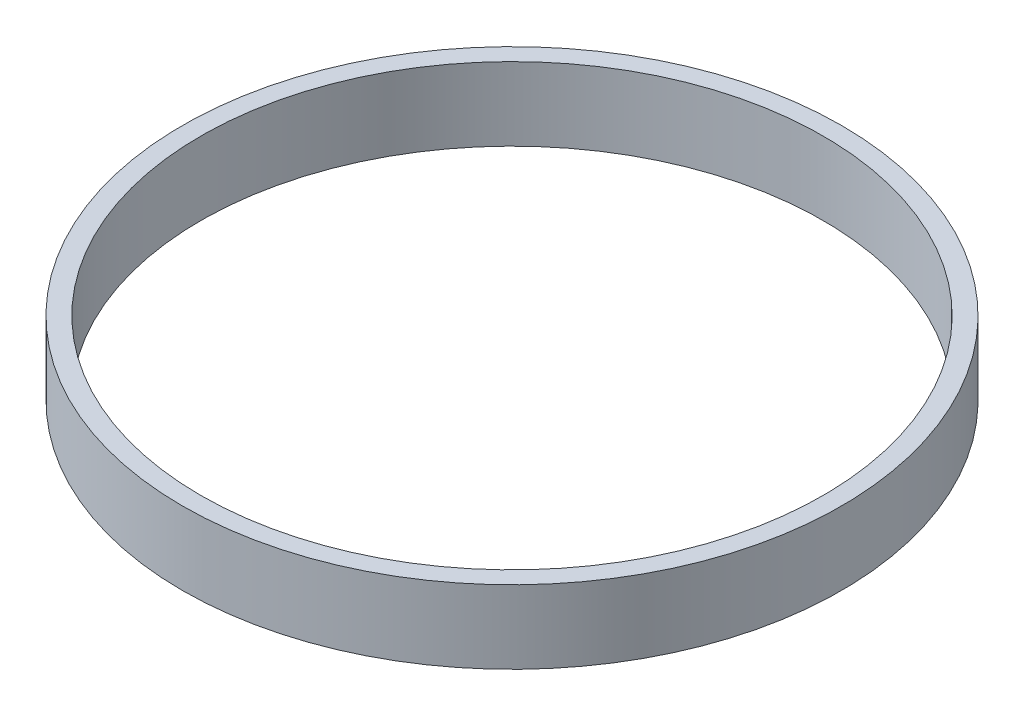
ISO-10303-21;
HEADER;
FILE_DESCRIPTION(('STEP AP214'),'2;1');
FILE_NAME('part.step','',(''),(''),'','','');
FILE_SCHEMA(('AUTOMOTIVE_DESIGN { 1 0 10303 214 1 1 1 1 }'));
ENDSEC;
DATA;
#1=APPLICATION_CONTEXT('core data for automotive mechanical design processes');
#2=APPLICATION_PROTOCOL_DEFINITION('international standard','automotive_design',2000,#1);
#3=PRODUCT_CONTEXT('',#1,'mechanical');
#4=PRODUCT('Part','Part','',(#3));
#5=PRODUCT_RELATED_PRODUCT_CATEGORY('part','',(#4));
#6=PRODUCT_DEFINITION_FORMATION('','',#4);
#7=PRODUCT_DEFINITION_CONTEXT('part definition',#1,'design');
#8=PRODUCT_DEFINITION('design','',#6,#7);
#9=PRODUCT_DEFINITION_SHAPE('','',#8);
#10=(LENGTH_UNIT() NAMED_UNIT(*) SI_UNIT(.MILLI.,.METRE.));
#11=(NAMED_UNIT(*) PLANE_ANGLE_UNIT() SI_UNIT($,.RADIAN.));
#12=(NAMED_UNIT(*) SI_UNIT($,.STERADIAN.) SOLID_ANGLE_UNIT());
#13=UNCERTAINTY_MEASURE_WITH_UNIT(LENGTH_MEASURE(1.E-05),#10,'distance_accuracy_value','');
#14=(GEOMETRIC_REPRESENTATION_CONTEXT(3) GLOBAL_UNCERTAINTY_ASSIGNED_CONTEXT((#13)) GLOBAL_UNIT_ASSIGNED_CONTEXT((#10,
#11,#12)) REPRESENTATION_CONTEXT('',''));
#15=CARTESIAN_POINT('',(0.,0.,0.));
#16=DIRECTION('',(0.,0.,1.));
#17=DIRECTION('',(1.,0.,0.));
#18=AXIS2_PLACEMENT_3D('',#15,#16,#17);
#19=CARTESIAN_POINT('',(0.,10.,0.));
#20=DIRECTION('',(0.,-1.,0.));
#21=DIRECTION('',(0.,0.,-1.));
#22=AXIS2_PLACEMENT_3D('',#19,#20,#21);
#23=CYLINDRICAL_SURFACE('',#22,45.);
#24=CARTESIAN_POINT('',(0.,10.,0.));
#25=DIRECTION('',(0.,1.,0.));
#26=DIRECTION('',(0.,0.,1.));
#27=AXIS2_PLACEMENT_3D('',#24,#25,#26);
#28=CIRCLE('',#27,45.);
#29=CARTESIAN_POINT('',(0.,10.,45.));
#30=VERTEX_POINT('',#29);
#31=EDGE_CURVE('E10',#30,#30,#28,.T.);
#32=ORIENTED_EDGE('',*,*,#31,.F.);
#33=EDGE_LOOP('',(#32));
#34=FACE_BOUND('',#33,.T.);
#35=CARTESIAN_POINT('',(0.,0.,0.));
#36=DIRECTION('',(0.,1.,0.));
#37=DIRECTION('',(0.,0.,1.));
#38=AXIS2_PLACEMENT_3D('',#35,#36,#37);
#39=CIRCLE('',#38,45.);
#40=CARTESIAN_POINT('',(0.,0.,45.));
#41=VERTEX_POINT('',#40);
#42=EDGE_CURVE('E37',#41,#41,#39,.T.);
#43=ORIENTED_EDGE('',*,*,#42,.T.);
#44=EDGE_LOOP('',(#43));
#45=FACE_BOUND('',#44,.T.);
#46=ADVANCED_FACE('F30',(#34,#45),#23,.T.);
#47=CARTESIAN_POINT('',(0.,10.,0.));
#48=DIRECTION('',(0.,1.,0.));
#49=DIRECTION('',(0.,0.,1.));
#50=AXIS2_PLACEMENT_3D('',#47,#48,#49);
#51=PLANE('',#50);
#52=CARTESIAN_POINT('',(0.,10.,0.));
#53=DIRECTION('',(0.,1.,0.));
#54=DIRECTION('',(0.,0.,1.));
#55=AXIS2_PLACEMENT_3D('',#52,#53,#54);
#56=CIRCLE('',#55,42.5);
#57=CARTESIAN_POINT('',(0.,10.,42.5));
#58=VERTEX_POINT('',#57);
#59=EDGE_CURVE('E43',#58,#58,#56,.T.);
#60=ORIENTED_EDGE('',*,*,#59,.F.);
#61=EDGE_LOOP('',(#60));
#62=FACE_BOUND('',#61,.T.);
#63=ORIENTED_EDGE('',*,*,#31,.T.);
#64=EDGE_LOOP('',(#63));
#65=FACE_BOUND('',#64,.T.);
#66=ADVANCED_FACE('F59',(#62,#65),#51,.T.);
#67=CARTESIAN_POINT('',(0.,0.,0.));
#68=DIRECTION('',(0.,1.,0.));
#69=DIRECTION('',(0.,0.,1.));
#70=AXIS2_PLACEMENT_3D('',#67,#68,#69);
#71=PLANE('',#70);
#72=CARTESIAN_POINT('',(0.,0.,0.));
#73=DIRECTION('',(0.,1.,0.));
#74=DIRECTION('',(0.,0.,1.));
#75=AXIS2_PLACEMENT_3D('',#72,#73,#74);
#76=CIRCLE('',#75,42.5);
#77=CARTESIAN_POINT('',(0.,0.,42.5));
#78=VERTEX_POINT('',#77);
#79=EDGE_CURVE('E33',#78,#78,#76,.T.);
#80=ORIENTED_EDGE('',*,*,#79,.T.);
#81=EDGE_LOOP('',(#80));
#82=FACE_BOUND('',#81,.T.);
#83=ORIENTED_EDGE('',*,*,#42,.F.);
#84=EDGE_LOOP('',(#83));
#85=FACE_BOUND('',#84,.T.);
#86=ADVANCED_FACE('F50',(#82,#85),#71,.F.);
#87=CARTESIAN_POINT('',(0.,-10.35,0.));
#88=DIRECTION('',(0.,1.,0.));
#89=DIRECTION('',(0.,0.,1.));
#90=AXIS2_PLACEMENT_3D('',#87,#88,#89);
#91=CYLINDRICAL_SURFACE('',#90,42.5);
#92=ORIENTED_EDGE('',*,*,#59,.T.);
#93=EDGE_LOOP('',(#92));
#94=FACE_BOUND('',#93,.T.);
#95=ORIENTED_EDGE('',*,*,#79,.F.);
#96=EDGE_LOOP('',(#95));
#97=FACE_BOUND('',#96,.T.);
#98=ADVANCED_FACE('F53',(#94,#97),#91,.F.);
#99=CLOSED_SHELL('',(#46,#66,#86,#98));
#100=MANIFOLD_SOLID_BREP('B2',#99);
#101=ADVANCED_BREP_SHAPE_REPRESENTATION('',(#18,#100),#14);
#102=SHAPE_DEFINITION_REPRESENTATION(#9,#101);
ENDSEC;
END-ISO-10303-21;
